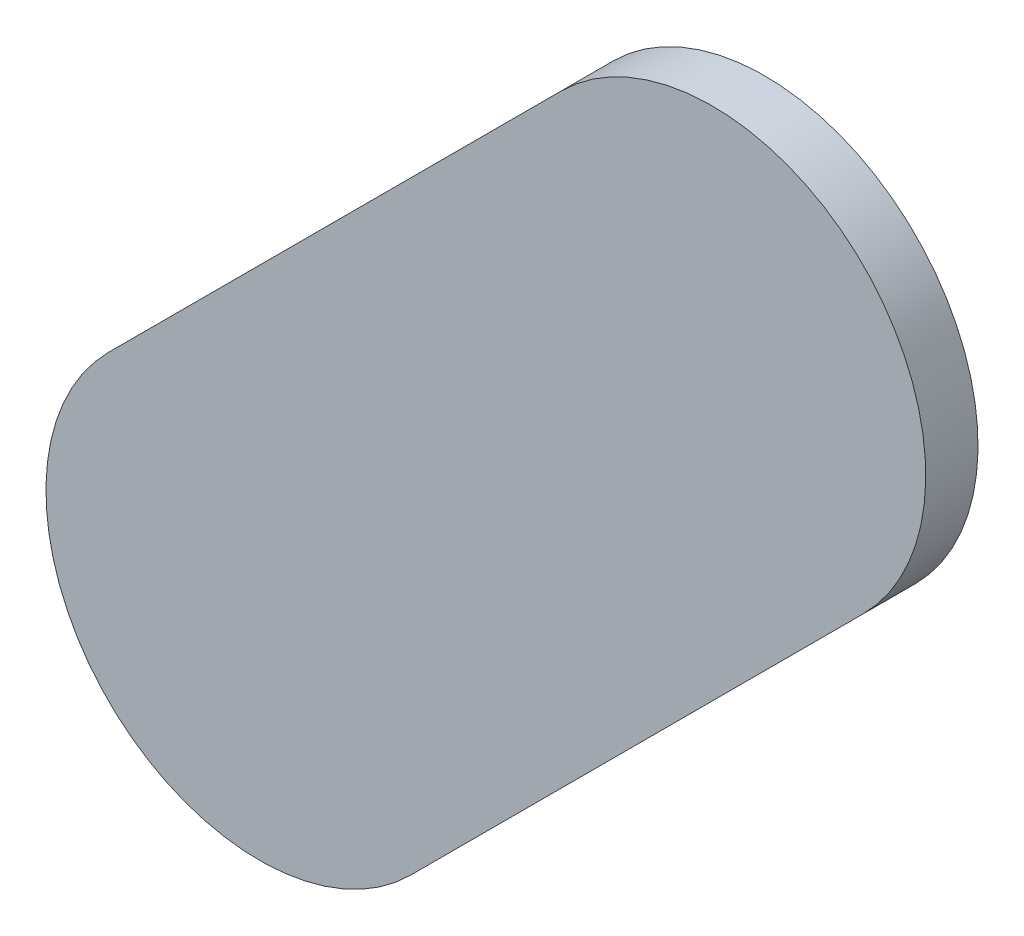
ISO-10303-21;
HEADER;
FILE_DESCRIPTION(('STEP AP214'),'2;1');
FILE_NAME('part.step','',(''),(''),'','','');
FILE_SCHEMA(('AUTOMOTIVE_DESIGN { 1 0 10303 214 1 1 1 1 }'));
ENDSEC;
DATA;
#1=APPLICATION_CONTEXT('core data for automotive mechanical design processes');
#2=APPLICATION_PROTOCOL_DEFINITION('international standard','automotive_design',2000,#1);
#3=PRODUCT_CONTEXT('',#1,'mechanical');
#4=PRODUCT('Part','Part','',(#3));
#5=PRODUCT_RELATED_PRODUCT_CATEGORY('part','',(#4));
#6=PRODUCT_DEFINITION_FORMATION('','',#4);
#7=PRODUCT_DEFINITION_CONTEXT('part definition',#1,'design');
#8=PRODUCT_DEFINITION('design','',#6,#7);
#9=PRODUCT_DEFINITION_SHAPE('','',#8);
#10=(LENGTH_UNIT() NAMED_UNIT(*) SI_UNIT(.MILLI.,.METRE.));
#11=(NAMED_UNIT(*) PLANE_ANGLE_UNIT() SI_UNIT($,.RADIAN.));
#12=(NAMED_UNIT(*) SI_UNIT($,.STERADIAN.) SOLID_ANGLE_UNIT());
#13=UNCERTAINTY_MEASURE_WITH_UNIT(LENGTH_MEASURE(1.E-05),#10,'distance_accuracy_value','');
#14=(GEOMETRIC_REPRESENTATION_CONTEXT(3) GLOBAL_UNCERTAINTY_ASSIGNED_CONTEXT((#13)) GLOBAL_UNIT_ASSIGNED_CONTEXT((#10,
#11,#12)) REPRESENTATION_CONTEXT('',''));
#15=CARTESIAN_POINT('',(0.,0.,0.));
#16=DIRECTION('',(0.,0.,1.));
#17=DIRECTION('',(1.,0.,0.));
#18=AXIS2_PLACEMENT_3D('',#15,#16,#17);
#19=CARTESIAN_POINT('',(4.433142089748,2.445374644465,0.79916));
#20=DIRECTION('',(0.,0.,1.));
#21=DIRECTION('',(1.,0.,0.));
#22=AXIS2_PLACEMENT_3D('',#19,#20,#21);
#23=PLANE('',#22);
#24=CARTESIAN_POINT('',(4.284649333,2.296882,0.79916));
#25=DIRECTION('',(0.,0.,1.));
#26=DIRECTION('',(1.,0.,0.));
#27=AXIS2_PLACEMENT_3D('',#24,#25,#26);
#28=CIRCLE('',#27,0.139999666);
#29=CARTESIAN_POINT('',(4.38364465012215,2.19788731612204,0.79916));
#30=VERTEX_POINT('',#29);
#31=CARTESIAN_POINT('',(4.18565473875643,2.39587683214002,0.79916));
#32=VERTEX_POINT('',#31);
#33=EDGE_CURVE('E20',#30,#32,#28,.F.);
#34=ORIENTED_EDGE('',*,*,#33,.F.);
#35=DIRECTION('',(-0.707106660628037,-0.707106901745037,0.));
#36=VECTOR('',#35,1.);
#37=CARTESIAN_POINT('',(4.680629282866,2.494872050135,0.79916));
#38=LINE('',#37,#36);
#39=CARTESIAN_POINT('',(4.68062945805482,2.49487222532388,0.79916));
#40=VERTEX_POINT('',#39);
#41=EDGE_CURVE('E65',#30,#40,#38,.F.);
#42=ORIENTED_EDGE('',*,*,#41,.T.);
#43=CARTESIAN_POINT('',(4.581634333,2.593867101268,0.79916));
#44=DIRECTION('',(0.,0.,1.));
#45=DIRECTION('',(1.,0.,0.));
#46=AXIS2_PLACEMENT_3D('',#43,#44,#45);
#47=CIRCLE('',#46,0.14);
#48=CARTESIAN_POINT('',(4.4826393105155,2.69286197751572,0.79916));
#49=VERTEX_POINT('',#48);
#50=EDGE_CURVE('E57',#49,#40,#47,.F.);
#51=ORIENTED_EDGE('',*,*,#50,.F.);
#52=DIRECTION('',(0.707106098309218,0.707107464063218,0.));
#53=VECTOR('',#52,1.);
#54=CARTESIAN_POINT('',(4.185654953307,2.395877046691,0.79916));
#55=LINE('',#54,#53);
#56=EDGE_CURVE('E64',#49,#32,#55,.F.);
#57=ORIENTED_EDGE('',*,*,#56,.T.);
#58=EDGE_LOOP('',(#34,#42,#51,#57));
#59=FACE_BOUND('',#58,.T.);
#60=ADVANCED_FACE('F17',(#59),#23,.T.);
#61=CARTESIAN_POINT('',(4.680629282866,2.494872050135,0.76487));
#62=DIRECTION('',(-0.707106901745037,0.707106660628037,0.));
#63=DIRECTION('',(-0.707106660628037,-0.707106901745037,0.));
#64=AXIS2_PLACEMENT_3D('',#61,#62,#63);
#65=PLANE('',#64);
#66=DIRECTION('',(0.,0.,1.));
#67=VECTOR('',#66,1.);
#68=CARTESIAN_POINT('',(4.3836446670001,2.1978873329999,0.76487));
#69=LINE('',#68,#67);
#70=CARTESIAN_POINT('',(4.38364465012214,2.19788731612203,0.76487));
#71=VERTEX_POINT('',#70);
#72=EDGE_CURVE('E68',#71,#30,#69,.T.);
#73=ORIENTED_EDGE('',*,*,#72,.F.);
#74=DIRECTION('',(-0.70710666062813,-0.707106901744944,0.));
#75=VECTOR('',#74,1.);
#76=CARTESIAN_POINT('',(4.680629282866,2.494872050135,0.76487));
#77=LINE('',#76,#75);
#78=CARTESIAN_POINT('',(4.68062945805481,2.49487222532387,0.76487));
#79=VERTEX_POINT('',#78);
#80=EDGE_CURVE('E72',#79,#71,#77,.T.);
#81=ORIENTED_EDGE('',*,*,#80,.F.);
#82=DIRECTION('',(0.,0.,1.));
#83=VECTOR('',#82,1.);
#84=CARTESIAN_POINT('',(4.680629282866,2.494872050135,0.76487));
#85=LINE('',#84,#83);
#86=EDGE_CURVE('E60',#40,#79,#85,.F.);
#87=ORIENTED_EDGE('',*,*,#86,.F.);
#88=ORIENTED_EDGE('',*,*,#41,.F.);
#89=EDGE_LOOP('',(#73,#81,#87,#88));
#90=FACE_BOUND('',#89,.T.);
#91=ADVANCED_FACE('F70',(#90),#65,.F.);
#92=CARTESIAN_POINT('',(4.284649333,2.296882,0.76487));
#93=DIRECTION('',(0.,0.,1.));
#94=DIRECTION('',(1.,0.,0.));
#95=AXIS2_PLACEMENT_3D('',#92,#93,#94);
#96=CYLINDRICAL_SURFACE('',#95,0.139999666);
#97=DIRECTION('',(0.,0.,1.));
#98=VECTOR('',#97,1.);
#99=CARTESIAN_POINT('',(4.185654953307,2.395877046691,0.76487));
#100=LINE('',#99,#98);
#101=CARTESIAN_POINT('',(4.18565473875646,2.39587683214004,0.76487));
#102=VERTEX_POINT('',#101);
#103=EDGE_CURVE('E77',#32,#102,#100,.F.);
#104=ORIENTED_EDGE('',*,*,#103,.T.);
#105=CARTESIAN_POINT('',(4.284649667,2.296882231732,0.76487));
#106=DIRECTION('',(0.,0.,1.));
#107=DIRECTION('',(1.,0.,0.));
#108=AXIS2_PLACEMENT_3D('',#105,#106,#107);
#109=CIRCLE('',#108,0.14);
#110=EDGE_CURVE('E26',#71,#102,#109,.F.);
#111=ORIENTED_EDGE('',*,*,#110,.F.);
#112=ORIENTED_EDGE('',*,*,#72,.T.);
#113=ORIENTED_EDGE('',*,*,#33,.T.);
#114=EDGE_LOOP('',(#104,#111,#112,#113));
#115=FACE_BOUND('',#114,.T.);
#116=ADVANCED_FACE('F88',(#115),#96,.T.);
#117=CARTESIAN_POINT('',(4.185654953307,2.395877046691,0.76487));
#118=DIRECTION('',(0.707107464063218,-0.707106098309218,0.));
#119=DIRECTION('',(0.707106098309218,0.707107464063218,0.));
#120=AXIS2_PLACEMENT_3D('',#117,#118,#119);
#121=PLANE('',#120);
#122=DIRECTION('',(0.,0.,1.));
#123=VECTOR('',#122,1.);
#124=CARTESIAN_POINT('',(4.4826393329999,2.6928620000001,0.76487));
#125=LINE('',#124,#123);
#126=CARTESIAN_POINT('',(4.48263931051563,2.69286197751564,0.76487));
#127=VERTEX_POINT('',#126);
#128=EDGE_CURVE('E62',#127,#49,#125,.T.);
#129=ORIENTED_EDGE('',*,*,#128,.F.);
#130=DIRECTION('',(0.70710609830961,0.707107464062826,0.));
#131=VECTOR('',#130,1.);
#132=CARTESIAN_POINT('',(4.185654953307,2.395877046691,0.76487));
#133=LINE('',#132,#131);
#134=EDGE_CURVE('E11',#102,#127,#133,.T.);
#135=ORIENTED_EDGE('',*,*,#134,.F.);
#136=ORIENTED_EDGE('',*,*,#103,.F.);
#137=ORIENTED_EDGE('',*,*,#56,.F.);
#138=EDGE_LOOP('',(#129,#135,#136,#137));
#139=FACE_BOUND('',#138,.T.);
#140=ADVANCED_FACE('F96',(#139),#121,.F.);
#141=CARTESIAN_POINT('',(4.581634333,2.593867101268,0.76487));
#142=DIRECTION('',(0.,0.,1.));
#143=DIRECTION('',(1.,0.,0.));
#144=AXIS2_PLACEMENT_3D('',#141,#142,#143);
#145=CYLINDRICAL_SURFACE('',#144,0.14);
#146=CARTESIAN_POINT('',(4.581634667,2.593867333,0.76487));
#147=DIRECTION('',(0.,0.,1.));
#148=DIRECTION('',(1.,0.,0.));
#149=AXIS2_PLACEMENT_3D('',#146,#147,#148);
#150=CIRCLE('',#149,0.14);
#151=EDGE_CURVE('E35',#127,#79,#150,.F.);
#152=ORIENTED_EDGE('',*,*,#151,.F.);
#153=ORIENTED_EDGE('',*,*,#128,.T.);
#154=ORIENTED_EDGE('',*,*,#50,.T.);
#155=ORIENTED_EDGE('',*,*,#86,.T.);
#156=EDGE_LOOP('',(#152,#153,#154,#155));
#157=FACE_BOUND('',#156,.T.);
#158=ADVANCED_FACE('F58',(#157),#145,.T.);
#159=CARTESIAN_POINT('',(4.433142089748,2.445374644465,0.76487));
#160=DIRECTION('',(0.,0.,-1.));
#161=DIRECTION('',(-1.,0.,0.));
#162=AXIS2_PLACEMENT_3D('',#159,#160,#161);
#163=PLANE('',#162);
#164=ORIENTED_EDGE('',*,*,#134,.T.);
#165=ORIENTED_EDGE('',*,*,#151,.T.);
#166=ORIENTED_EDGE('',*,*,#80,.T.);
#167=ORIENTED_EDGE('',*,*,#110,.T.);
#168=EDGE_LOOP('',(#164,#165,#166,#167));
#169=FACE_BOUND('',#168,.T.);
#170=ADVANCED_FACE('F89',(#169),#163,.T.);
#171=CLOSED_SHELL('',(#60,#91,#116,#140,#158,#170));
#172=MANIFOLD_SOLID_BREP('B1',#171);
#173=ADVANCED_BREP_SHAPE_REPRESENTATION('',(#18,#172),#14);
#174=SHAPE_DEFINITION_REPRESENTATION(#9,#173);
ENDSEC;
END-ISO-10303-21;
